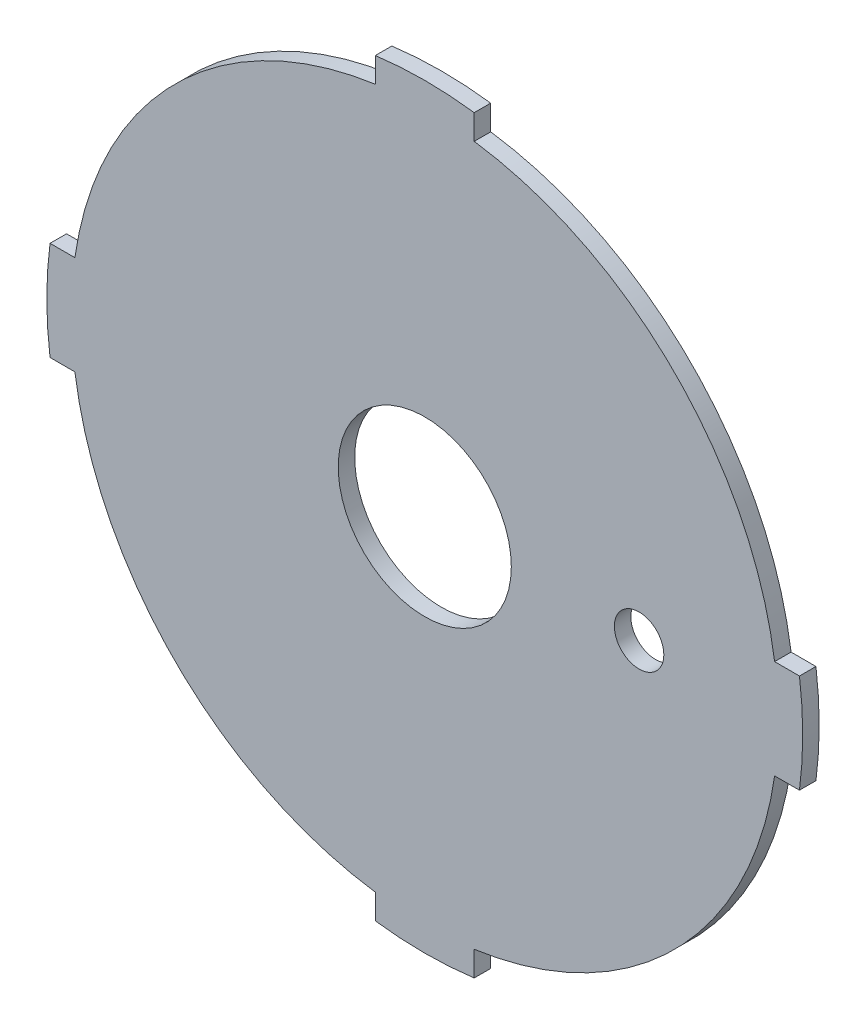
ISO-10303-21;
HEADER;
FILE_DESCRIPTION(('STEP AP214'),'2;1');
FILE_NAME('part.step','',(''),(''),'','','');
FILE_SCHEMA(('AUTOMOTIVE_DESIGN { 1 0 10303 214 1 1 1 1 }'));
ENDSEC;
DATA;
#1=APPLICATION_CONTEXT('core data for automotive mechanical design processes');
#2=APPLICATION_PROTOCOL_DEFINITION('international standard','automotive_design',2000,#1);
#3=PRODUCT_CONTEXT('',#1,'mechanical');
#4=PRODUCT('Part','Part','',(#3));
#5=PRODUCT_RELATED_PRODUCT_CATEGORY('part','',(#4));
#6=PRODUCT_DEFINITION_FORMATION('','',#4);
#7=PRODUCT_DEFINITION_CONTEXT('part definition',#1,'design');
#8=PRODUCT_DEFINITION('design','',#6,#7);
#9=PRODUCT_DEFINITION_SHAPE('','',#8);
#10=(LENGTH_UNIT() NAMED_UNIT(*) SI_UNIT(.MILLI.,.METRE.));
#11=(NAMED_UNIT(*) PLANE_ANGLE_UNIT() SI_UNIT($,.RADIAN.));
#12=(NAMED_UNIT(*) SI_UNIT($,.STERADIAN.) SOLID_ANGLE_UNIT());
#13=UNCERTAINTY_MEASURE_WITH_UNIT(LENGTH_MEASURE(1.E-05),#10,'distance_accuracy_value','');
#14=(GEOMETRIC_REPRESENTATION_CONTEXT(3) GLOBAL_UNCERTAINTY_ASSIGNED_CONTEXT((#13)) GLOBAL_UNIT_ASSIGNED_CONTEXT((#10,
#11,#12)) REPRESENTATION_CONTEXT('',''));
#15=CARTESIAN_POINT('',(0.,0.,0.));
#16=DIRECTION('',(0.,0.,1.));
#17=DIRECTION('',(1.,0.,0.));
#18=AXIS2_PLACEMENT_3D('',#15,#16,#17);
#19=CARTESIAN_POINT('',(0.,0.,2.));
#20=DIRECTION('',(0.,0.,-1.));
#21=DIRECTION('',(-1.,0.,0.));
#22=AXIS2_PLACEMENT_3D('',#19,#20,#21);
#23=CYLINDRICAL_SURFACE('',#22,45.85);
#24=CARTESIAN_POINT('',(0.,0.,0.));
#25=DIRECTION('',(0.,0.,1.));
#26=DIRECTION('',(1.,0.,0.));
#27=AXIS2_PLACEMENT_3D('',#24,#25,#26);
#28=CIRCLE('',#27,45.85);
#29=CARTESIAN_POINT('',(-5.99999999999968,-45.4557202120922,0.));
#30=VERTEX_POINT('',#29);
#31=CARTESIAN_POINT('',(6.00000000000047,-45.4557202120921,0.));
#32=VERTEX_POINT('',#31);
#33=EDGE_CURVE('E223',#30,#32,#28,.T.);
#34=ORIENTED_EDGE('',*,*,#33,.T.);
#35=DIRECTION('',(0.,0.,-1.));
#36=VECTOR('',#35,1.);
#37=CARTESIAN_POINT('',(6.00000000000047,-45.4557202120921,2.001));
#38=LINE('',#37,#36);
#39=CARTESIAN_POINT('',(6.00000000000047,-45.4557202120921,2.));
#40=VERTEX_POINT('',#39);
#41=EDGE_CURVE('E235',#40,#32,#38,.T.);
#42=ORIENTED_EDGE('',*,*,#41,.F.);
#43=CARTESIAN_POINT('',(0.,0.,2.));
#44=DIRECTION('',(0.,0.,1.));
#45=DIRECTION('',(1.,0.,0.));
#46=AXIS2_PLACEMENT_3D('',#43,#44,#45);
#47=CIRCLE('',#46,45.85);
#48=CARTESIAN_POINT('',(-5.99999999999971,-45.4557202120921,2.));
#49=VERTEX_POINT('',#48);
#50=EDGE_CURVE('E214',#49,#40,#47,.T.);
#51=ORIENTED_EDGE('',*,*,#50,.F.);
#52=DIRECTION('',(0.,0.,-1.));
#53=VECTOR('',#52,1.);
#54=CARTESIAN_POINT('',(-5.99999999999971,-45.4557202120921,2.001));
#55=LINE('',#54,#53);
#56=EDGE_CURVE('E236',#49,#30,#55,.T.);
#57=ORIENTED_EDGE('',*,*,#56,.T.);
#58=EDGE_LOOP('',(#34,#42,#51,#57));
#59=FACE_BOUND('',#58,.T.);
#60=ADVANCED_FACE('F38',(#59),#23,.T.);
#61=CARTESIAN_POINT('',(-45.4557202120921,5.99999999999984,0.));
#62=VERTEX_POINT('',#61);
#63=CARTESIAN_POINT('',(-45.4557202120921,-6.00000000000031,0.));
#64=VERTEX_POINT('',#63);
#65=EDGE_CURVE('E220',#62,#64,#28,.T.);
#66=ORIENTED_EDGE('',*,*,#65,.T.);
#67=DIRECTION('',(0.,0.,-1.));
#68=VECTOR('',#67,1.);
#69=CARTESIAN_POINT('',(-45.4557202120921,-6.00000000000031,2.001));
#70=LINE('',#69,#68);
#71=CARTESIAN_POINT('',(-45.4557202120921,-6.00000000000031,2.));
#72=VERTEX_POINT('',#71);
#73=EDGE_CURVE('E342',#72,#64,#70,.T.);
#74=ORIENTED_EDGE('',*,*,#73,.F.);
#75=CARTESIAN_POINT('',(-45.4557202120921,5.99999999999985,2.));
#76=VERTEX_POINT('',#75);
#77=EDGE_CURVE('E48',#76,#72,#47,.T.);
#78=ORIENTED_EDGE('',*,*,#77,.F.);
#79=DIRECTION('',(0.,0.,-1.));
#80=VECTOR('',#79,1.);
#81=CARTESIAN_POINT('',(-45.4557202120921,5.99999999999985,2.001));
#82=LINE('',#81,#80);
#83=EDGE_CURVE('E175',#76,#62,#82,.T.);
#84=ORIENTED_EDGE('',*,*,#83,.T.);
#85=EDGE_LOOP('',(#66,#74,#78,#84));
#86=FACE_BOUND('',#85,.T.);
#87=ADVANCED_FACE('F377',(#86),#23,.T.);
#88=CARTESIAN_POINT('',(6.,45.4557202120921,0.));
#89=VERTEX_POINT('',#88);
#90=CARTESIAN_POINT('',(-6.00000000000016,45.4557202120921,0.));
#91=VERTEX_POINT('',#90);
#92=EDGE_CURVE('E173',#89,#91,#28,.T.);
#93=ORIENTED_EDGE('',*,*,#92,.T.);
#94=DIRECTION('',(0.,0.,-1.));
#95=VECTOR('',#94,1.);
#96=CARTESIAN_POINT('',(-6.00000000000016,45.4557202120921,2.001));
#97=LINE('',#96,#95);
#98=CARTESIAN_POINT('',(-6.00000000000016,45.4557202120921,2.));
#99=VERTEX_POINT('',#98);
#100=EDGE_CURVE('E158',#99,#91,#97,.T.);
#101=ORIENTED_EDGE('',*,*,#100,.F.);
#102=CARTESIAN_POINT('',(6.,45.4557202120921,2.));
#103=VERTEX_POINT('',#102);
#104=EDGE_CURVE('E11',#103,#99,#47,.T.);
#105=ORIENTED_EDGE('',*,*,#104,.F.);
#106=DIRECTION('',(0.,0.,-1.));
#107=VECTOR('',#106,1.);
#108=CARTESIAN_POINT('',(6.,45.4557202120921,2.001));
#109=LINE('',#108,#107);
#110=EDGE_CURVE('E288',#103,#89,#109,.T.);
#111=ORIENTED_EDGE('',*,*,#110,.T.);
#112=EDGE_LOOP('',(#93,#101,#105,#111));
#113=FACE_BOUND('',#112,.T.);
#114=ADVANCED_FACE('F170',(#113),#23,.T.);
#115=CARTESIAN_POINT('',(0.,0.,2.));
#116=DIRECTION('',(0.,0.,1.));
#117=DIRECTION('',(1.,0.,0.));
#118=AXIS2_PLACEMENT_3D('',#115,#116,#117);
#119=PLANE('',#118);
#120=DIRECTION('',(0.,1.,0.));
#121=VECTOR('',#120,1.);
#122=CARTESIAN_POINT('',(6.00000000000044,-42.4379499976141,2.));
#123=LINE('',#122,#121);
#124=CARTESIAN_POINT('',(6.00000000000044,-42.4379499976141,2.));
#125=VERTEX_POINT('',#124);
#126=EDGE_CURVE('E356',#40,#125,#123,.T.);
#127=ORIENTED_EDGE('',*,*,#126,.T.);
#128=CARTESIAN_POINT('',(0.,0.,2.));
#129=DIRECTION('',(0.,0.,1.));
#130=DIRECTION('',(1.,0.,0.));
#131=AXIS2_PLACEMENT_3D('',#128,#129,#130);
#132=CIRCLE('',#131,42.86);
#133=CARTESIAN_POINT('',(42.4379499976142,-5.99999999999956,2.));
#134=VERTEX_POINT('',#133);
#135=EDGE_CURVE('E352',#125,#134,#132,.T.);
#136=ORIENTED_EDGE('',*,*,#135,.T.);
#137=DIRECTION('',(1.,0.,0.));
#138=VECTOR('',#137,1.);
#139=CARTESIAN_POINT('',(42.4379499976142,-5.99999999999956,2.));
#140=LINE('',#139,#138);
#141=CARTESIAN_POINT('',(45.4557202120922,-5.99999999999955,2.));
#142=VERTEX_POINT('',#141);
#143=EDGE_CURVE('E262',#134,#142,#140,.T.);
#144=ORIENTED_EDGE('',*,*,#143,.T.);
#145=CARTESIAN_POINT('',(45.4557202120921,6.,2.));
#146=VERTEX_POINT('',#145);
#147=EDGE_CURVE('E49',#142,#146,#47,.T.);
#148=ORIENTED_EDGE('',*,*,#147,.T.);
#149=DIRECTION('',(-1.,0.,0.));
#150=VECTOR('',#149,1.);
#151=CARTESIAN_POINT('',(42.4379499976142,5.99999999999999,2.));
#152=LINE('',#151,#150);
#153=CARTESIAN_POINT('',(42.4379499976142,5.99999999999999,2.));
#154=VERTEX_POINT('',#153);
#155=EDGE_CURVE('E272',#146,#154,#152,.T.);
#156=ORIENTED_EDGE('',*,*,#155,.T.);
#157=CARTESIAN_POINT('',(0.,0.,2.));
#158=DIRECTION('',(0.,0.,1.));
#159=DIRECTION('',(1.,0.,0.));
#160=AXIS2_PLACEMENT_3D('',#157,#158,#159);
#161=CIRCLE('',#160,42.86);
#162=CARTESIAN_POINT('',(6.,42.4379499976142,2.));
#163=VERTEX_POINT('',#162);
#164=EDGE_CURVE('E184',#154,#163,#161,.T.);
#165=ORIENTED_EDGE('',*,*,#164,.T.);
#166=DIRECTION('',(0.,1.,0.));
#167=VECTOR('',#166,1.);
#168=CARTESIAN_POINT('',(6.,42.4379499976142,2.));
#169=LINE('',#168,#167);
#170=EDGE_CURVE('E182',#163,#103,#169,.T.);
#171=ORIENTED_EDGE('',*,*,#170,.T.);
#172=ORIENTED_EDGE('',*,*,#104,.T.);
#173=DIRECTION('',(0.,-1.,0.));
#174=VECTOR('',#173,1.);
#175=CARTESIAN_POINT('',(-6.00000000000015,42.4379499976141,2.));
#176=LINE('',#175,#174);
#177=CARTESIAN_POINT('',(-6.00000000000015,42.4379499976142,2.));
#178=VERTEX_POINT('',#177);
#179=EDGE_CURVE('E154',#99,#178,#176,.T.);
#180=ORIENTED_EDGE('',*,*,#179,.T.);
#181=CARTESIAN_POINT('',(0.,0.,2.));
#182=DIRECTION('',(0.,0.,1.));
#183=DIRECTION('',(1.,0.,0.));
#184=AXIS2_PLACEMENT_3D('',#181,#182,#183);
#185=CIRCLE('',#184,42.86);
#186=CARTESIAN_POINT('',(-42.4379499976142,5.99999999999985,2.));
#187=VERTEX_POINT('',#186);
#188=EDGE_CURVE('E165',#178,#187,#185,.T.);
#189=ORIENTED_EDGE('',*,*,#188,.T.);
#190=DIRECTION('',(-1.,0.,0.));
#191=VECTOR('',#190,1.);
#192=CARTESIAN_POINT('',(-42.4379499976142,5.99999999999985,2.));
#193=LINE('',#192,#191);
#194=EDGE_CURVE('E273',#187,#76,#193,.T.);
#195=ORIENTED_EDGE('',*,*,#194,.T.);
#196=ORIENTED_EDGE('',*,*,#77,.T.);
#197=DIRECTION('',(1.,0.,0.));
#198=VECTOR('',#197,1.);
#199=CARTESIAN_POINT('',(-42.4379499976141,-6.00000000000029,2.));
#200=LINE('',#199,#198);
#201=CARTESIAN_POINT('',(-42.4379499976141,-6.00000000000029,2.));
#202=VERTEX_POINT('',#201);
#203=EDGE_CURVE('E323',#72,#202,#200,.T.);
#204=ORIENTED_EDGE('',*,*,#203,.T.);
#205=CARTESIAN_POINT('',(0.,0.,2.));
#206=DIRECTION('',(0.,0.,1.));
#207=DIRECTION('',(1.,0.,0.));
#208=AXIS2_PLACEMENT_3D('',#205,#206,#207);
#209=CIRCLE('',#208,42.86);
#210=CARTESIAN_POINT('',(-5.9999999999997,-42.4379499976142,2.));
#211=VERTEX_POINT('',#210);
#212=EDGE_CURVE('E269',#202,#211,#209,.T.);
#213=ORIENTED_EDGE('',*,*,#212,.T.);
#214=DIRECTION('',(0.,-1.,0.));
#215=VECTOR('',#214,1.);
#216=CARTESIAN_POINT('',(-5.9999999999997,-42.4379499976142,2.));
#217=LINE('',#216,#215);
#218=EDGE_CURVE('E341',#211,#49,#217,.T.);
#219=ORIENTED_EDGE('',*,*,#218,.T.);
#220=ORIENTED_EDGE('',*,*,#50,.T.);
#221=EDGE_LOOP('',(#127,#136,#144,#148,#156,#165,#171,#172,#180,#189,#195,#196,#204,#213,#219,#220));
#222=FACE_BOUND('',#221,.T.);
#223=CARTESIAN_POINT('',(26.,0.,2.));
#224=DIRECTION('',(0.,0.,1.));
#225=DIRECTION('',(1.,0.,0.));
#226=AXIS2_PLACEMENT_3D('',#223,#224,#225);
#227=CIRCLE('',#226,3.);
#228=CARTESIAN_POINT('',(29.,0.,2.));
#229=VERTEX_POINT('',#228);
#230=EDGE_CURVE('E188',#229,#229,#227,.F.);
#231=ORIENTED_EDGE('',*,*,#230,.T.);
#232=EDGE_LOOP('',(#231));
#233=FACE_BOUND('',#232,.T.);
#234=CARTESIAN_POINT('',(0.,0.,2.));
#235=DIRECTION('',(0.,0.,1.));
#236=DIRECTION('',(1.,0.,0.));
#237=AXIS2_PLACEMENT_3D('',#234,#235,#236);
#238=CIRCLE('',#237,10.5);
#239=CARTESIAN_POINT('',(10.5,0.,2.));
#240=VERTEX_POINT('',#239);
#241=EDGE_CURVE('E206',#240,#240,#238,.T.);
#242=ORIENTED_EDGE('',*,*,#241,.F.);
#243=EDGE_LOOP('',(#242));
#244=FACE_BOUND('',#243,.T.);
#245=ADVANCED_FACE('F179',(#222,#233,#244),#119,.T.);
#246=CARTESIAN_POINT('',(0.,0.,0.));
#247=DIRECTION('',(0.,0.,1.));
#248=DIRECTION('',(1.,0.,0.));
#249=AXIS2_PLACEMENT_3D('',#246,#247,#248);
#250=PLANE('',#249);
#251=CARTESIAN_POINT('',(26.,0.,0.));
#252=DIRECTION('',(0.,0.,-1.));
#253=DIRECTION('',(-1.,0.,0.));
#254=AXIS2_PLACEMENT_3D('',#251,#252,#253);
#255=CIRCLE('',#254,3.);
#256=CARTESIAN_POINT('',(23.,0.,0.));
#257=VERTEX_POINT('',#256);
#258=EDGE_CURVE('E194',#257,#257,#255,.T.);
#259=ORIENTED_EDGE('',*,*,#258,.F.);
#260=EDGE_LOOP('',(#259));
#261=FACE_BOUND('',#260,.T.);
#262=CARTESIAN_POINT('',(0.,0.,0.));
#263=DIRECTION('',(0.,0.,1.));
#264=DIRECTION('',(1.,0.,0.));
#265=AXIS2_PLACEMENT_3D('',#262,#263,#264);
#266=CIRCLE('',#265,42.86);
#267=CARTESIAN_POINT('',(6.00000000000044,-42.4379499976141,0.));
#268=VERTEX_POINT('',#267);
#269=CARTESIAN_POINT('',(42.4379499976142,-5.99999999999956,0.));
#270=VERTEX_POINT('',#269);
#271=EDGE_CURVE('E246',#268,#270,#266,.T.);
#272=ORIENTED_EDGE('',*,*,#271,.F.);
#273=DIRECTION('',(0.,1.,0.));
#274=VECTOR('',#273,1.);
#275=CARTESIAN_POINT('',(6.00000000000044,-42.4379499976141,0.));
#276=LINE('',#275,#274);
#277=EDGE_CURVE('E244',#32,#268,#276,.T.);
#278=ORIENTED_EDGE('',*,*,#277,.F.);
#279=ORIENTED_EDGE('',*,*,#33,.F.);
#280=DIRECTION('',(0.,-1.,0.));
#281=VECTOR('',#280,1.);
#282=CARTESIAN_POINT('',(-5.9999999999997,-42.4379499976142,0.));
#283=LINE('',#282,#281);
#284=CARTESIAN_POINT('',(-5.9999999999997,-42.4379499976142,0.));
#285=VERTEX_POINT('',#284);
#286=EDGE_CURVE('E64',#285,#30,#283,.T.);
#287=ORIENTED_EDGE('',*,*,#286,.F.);
#288=CARTESIAN_POINT('',(0.,0.,0.));
#289=DIRECTION('',(0.,0.,1.));
#290=DIRECTION('',(1.,0.,0.));
#291=AXIS2_PLACEMENT_3D('',#288,#289,#290);
#292=CIRCLE('',#291,42.86);
#293=CARTESIAN_POINT('',(-42.4379499976141,-6.00000000000029,0.));
#294=VERTEX_POINT('',#293);
#295=EDGE_CURVE('E327',#294,#285,#292,.T.);
#296=ORIENTED_EDGE('',*,*,#295,.F.);
#297=DIRECTION('',(1.,0.,0.));
#298=VECTOR('',#297,1.);
#299=CARTESIAN_POINT('',(-42.4379499976141,-6.00000000000029,0.));
#300=LINE('',#299,#298);
#301=EDGE_CURVE('E333',#64,#294,#300,.T.);
#302=ORIENTED_EDGE('',*,*,#301,.F.);
#303=ORIENTED_EDGE('',*,*,#65,.F.);
#304=DIRECTION('',(-1.,0.,0.));
#305=VECTOR('',#304,1.);
#306=CARTESIAN_POINT('',(-42.4379499976142,5.99999999999985,0.));
#307=LINE('',#306,#305);
#308=CARTESIAN_POINT('',(-42.4379499976142,5.99999999999985,0.));
#309=VERTEX_POINT('',#308);
#310=EDGE_CURVE('E304',#309,#62,#307,.T.);
#311=ORIENTED_EDGE('',*,*,#310,.F.);
#312=CARTESIAN_POINT('',(0.,0.,0.));
#313=DIRECTION('',(0.,0.,1.));
#314=DIRECTION('',(1.,0.,0.));
#315=AXIS2_PLACEMENT_3D('',#312,#313,#314);
#316=CIRCLE('',#315,42.86);
#317=CARTESIAN_POINT('',(-6.00000000000015,42.4379499976141,0.));
#318=VERTEX_POINT('',#317);
#319=EDGE_CURVE('E164',#318,#309,#316,.T.);
#320=ORIENTED_EDGE('',*,*,#319,.F.);
#321=DIRECTION('',(0.,-1.,0.));
#322=VECTOR('',#321,1.);
#323=CARTESIAN_POINT('',(-6.00000000000015,42.4379499976141,0.));
#324=LINE('',#323,#322);
#325=EDGE_CURVE('E299',#91,#318,#324,.T.);
#326=ORIENTED_EDGE('',*,*,#325,.F.);
#327=ORIENTED_EDGE('',*,*,#92,.F.);
#328=DIRECTION('',(0.,1.,0.));
#329=VECTOR('',#328,1.);
#330=CARTESIAN_POINT('',(6.,42.4379499976142,0.));
#331=LINE('',#330,#329);
#332=CARTESIAN_POINT('',(6.,42.4379499976142,0.));
#333=VERTEX_POINT('',#332);
#334=EDGE_CURVE('E280',#333,#89,#331,.T.);
#335=ORIENTED_EDGE('',*,*,#334,.F.);
#336=CARTESIAN_POINT('',(0.,0.,0.));
#337=DIRECTION('',(0.,0.,1.));
#338=DIRECTION('',(1.,0.,0.));
#339=AXIS2_PLACEMENT_3D('',#336,#337,#338);
#340=CIRCLE('',#339,42.86);
#341=CARTESIAN_POINT('',(42.4379499976142,5.99999999999999,0.));
#342=VERTEX_POINT('',#341);
#343=EDGE_CURVE('E276',#342,#333,#340,.T.);
#344=ORIENTED_EDGE('',*,*,#343,.F.);
#345=DIRECTION('',(-1.,0.,0.));
#346=VECTOR('',#345,1.);
#347=CARTESIAN_POINT('',(42.4379499976142,5.99999999999999,0.));
#348=LINE('',#347,#346);
#349=CARTESIAN_POINT('',(45.4557202120921,5.99999999999999,0.));
#350=VERTEX_POINT('',#349);
#351=EDGE_CURVE('E283',#350,#342,#348,.T.);
#352=ORIENTED_EDGE('',*,*,#351,.F.);
#353=CARTESIAN_POINT('',(45.4557202120922,-5.99999999999952,0.));
#354=VERTEX_POINT('',#353);
#355=EDGE_CURVE('E42',#354,#350,#28,.T.);
#356=ORIENTED_EDGE('',*,*,#355,.F.);
#357=DIRECTION('',(1.,0.,0.));
#358=VECTOR('',#357,1.);
#359=CARTESIAN_POINT('',(42.4379499976142,-5.99999999999956,0.));
#360=LINE('',#359,#358);
#361=EDGE_CURVE('E56',#270,#354,#360,.T.);
#362=ORIENTED_EDGE('',*,*,#361,.F.);
#363=EDGE_LOOP('',(#272,#278,#279,#287,#296,#302,#303,#311,#320,#326,#327,#335,#344,#352,#356,#362));
#364=FACE_BOUND('',#363,.T.);
#365=CARTESIAN_POINT('',(0.,0.,0.));
#366=DIRECTION('',(0.,0.,1.));
#367=DIRECTION('',(1.,0.,0.));
#368=AXIS2_PLACEMENT_3D('',#365,#366,#367);
#369=CIRCLE('',#368,10.5);
#370=CARTESIAN_POINT('',(10.5,0.,0.));
#371=VERTEX_POINT('',#370);
#372=EDGE_CURVE('E204',#371,#371,#369,.T.);
#373=ORIENTED_EDGE('',*,*,#372,.T.);
#374=EDGE_LOOP('',(#373));
#375=FACE_BOUND('',#374,.T.);
#376=ADVANCED_FACE('F240',(#261,#364,#375),#250,.F.);
#377=ORIENTED_EDGE('',*,*,#147,.F.);
#378=DIRECTION('',(0.,0.,-1.));
#379=VECTOR('',#378,1.);
#380=CARTESIAN_POINT('',(45.4557202120922,-5.99999999999955,2.001));
#381=LINE('',#380,#379);
#382=EDGE_CURVE('E254',#142,#354,#381,.T.);
#383=ORIENTED_EDGE('',*,*,#382,.T.);
#384=ORIENTED_EDGE('',*,*,#355,.T.);
#385=DIRECTION('',(0.,0.,-1.));
#386=VECTOR('',#385,1.);
#387=CARTESIAN_POINT('',(45.4557202120921,5.99999999999999,2.001));
#388=LINE('',#387,#386);
#389=EDGE_CURVE('E196',#146,#350,#388,.T.);
#390=ORIENTED_EDGE('',*,*,#389,.F.);
#391=EDGE_LOOP('',(#377,#383,#384,#390));
#392=FACE_BOUND('',#391,.T.);
#393=ADVANCED_FACE('F40',(#392),#23,.T.);
#394=CARTESIAN_POINT('',(0.,0.,2.));
#395=DIRECTION('',(0.,0.,-1.));
#396=DIRECTION('',(-1.,0.,0.));
#397=AXIS2_PLACEMENT_3D('',#394,#395,#396);
#398=CYLINDRICAL_SURFACE('',#397,10.5);
#399=ORIENTED_EDGE('',*,*,#241,.T.);
#400=EDGE_LOOP('',(#399));
#401=FACE_BOUND('',#400,.T.);
#402=ORIENTED_EDGE('',*,*,#372,.F.);
#403=EDGE_LOOP('',(#402));
#404=FACE_BOUND('',#403,.T.);
#405=ADVANCED_FACE('F384',(#401,#404),#398,.F.);
#406=CARTESIAN_POINT('',(26.,0.,2.001));
#407=DIRECTION('',(0.,0.,-1.));
#408=DIRECTION('',(-1.,0.,0.));
#409=AXIS2_PLACEMENT_3D('',#406,#407,#408);
#410=CYLINDRICAL_SURFACE('',#409,3.);
#411=ORIENTED_EDGE('',*,*,#230,.F.);
#412=EDGE_LOOP('',(#411));
#413=FACE_BOUND('',#412,.T.);
#414=ORIENTED_EDGE('',*,*,#258,.T.);
#415=EDGE_LOOP('',(#414));
#416=FACE_BOUND('',#415,.T.);
#417=ADVANCED_FACE('F390',(#413,#416),#410,.F.);
#418=CARTESIAN_POINT('',(0.,0.,2.001));
#419=DIRECTION('',(0.,0.,-1.));
#420=DIRECTION('',(-1.,0.,0.));
#421=AXIS2_PLACEMENT_3D('',#418,#419,#420);
#422=CYLINDRICAL_SURFACE('',#421,42.86);
#423=DIRECTION('',(0.,0.,-1.));
#424=VECTOR('',#423,1.);
#425=CARTESIAN_POINT('',(42.4379499976142,5.99999999999999,2.001));
#426=LINE('',#425,#424);
#427=EDGE_CURVE('E189',#154,#342,#426,.T.);
#428=ORIENTED_EDGE('',*,*,#427,.T.);
#429=ORIENTED_EDGE('',*,*,#343,.T.);
#430=DIRECTION('',(0.,0.,-1.));
#431=VECTOR('',#430,1.);
#432=CARTESIAN_POINT('',(6.,42.4379499976142,2.001));
#433=LINE('',#432,#431);
#434=EDGE_CURVE('E200',#163,#333,#433,.T.);
#435=ORIENTED_EDGE('',*,*,#434,.F.);
#436=ORIENTED_EDGE('',*,*,#164,.F.);
#437=EDGE_LOOP('',(#428,#429,#435,#436));
#438=FACE_BOUND('',#437,.T.);
#439=ADVANCED_FACE('F295',(#438),#422,.T.);
#440=CARTESIAN_POINT('',(42.4379499976142,5.99999999999999,2.001));
#441=DIRECTION('',(0.,-1.,0.));
#442=DIRECTION('',(0.,0.,-1.));
#443=AXIS2_PLACEMENT_3D('',#440,#441,#442);
#444=PLANE('',#443);
#445=ORIENTED_EDGE('',*,*,#389,.T.);
#446=ORIENTED_EDGE('',*,*,#351,.T.);
#447=ORIENTED_EDGE('',*,*,#427,.F.);
#448=ORIENTED_EDGE('',*,*,#155,.F.);
#449=EDGE_LOOP('',(#445,#446,#447,#448));
#450=FACE_BOUND('',#449,.T.);
#451=ADVANCED_FACE('F363',(#450),#444,.F.);
#452=CARTESIAN_POINT('',(6.,42.4379499976142,2.001));
#453=DIRECTION('',(-1.,0.,0.));
#454=DIRECTION('',(0.,-1.,0.));
#455=AXIS2_PLACEMENT_3D('',#452,#453,#454);
#456=PLANE('',#455);
#457=ORIENTED_EDGE('',*,*,#434,.T.);
#458=ORIENTED_EDGE('',*,*,#334,.T.);
#459=ORIENTED_EDGE('',*,*,#110,.F.);
#460=ORIENTED_EDGE('',*,*,#170,.F.);
#461=EDGE_LOOP('',(#457,#458,#459,#460));
#462=FACE_BOUND('',#461,.T.);
#463=ADVANCED_FACE('F291',(#462),#456,.F.);
#464=CARTESIAN_POINT('',(0.,0.,2.001));
#465=DIRECTION('',(0.,0.,-1.));
#466=DIRECTION('',(-1.,0.,0.));
#467=AXIS2_PLACEMENT_3D('',#464,#465,#466);
#468=CYLINDRICAL_SURFACE('',#467,42.86);
#469=DIRECTION('',(0.,0.,-1.));
#470=VECTOR('',#469,1.);
#471=CARTESIAN_POINT('',(-6.00000000000015,42.4379499976141,2.001));
#472=LINE('',#471,#470);
#473=EDGE_CURVE('E160',#178,#318,#472,.T.);
#474=ORIENTED_EDGE('',*,*,#473,.T.);
#475=ORIENTED_EDGE('',*,*,#319,.T.);
#476=DIRECTION('',(0.,0.,-1.));
#477=VECTOR('',#476,1.);
#478=CARTESIAN_POINT('',(-42.4379499976142,5.99999999999985,2.001));
#479=LINE('',#478,#477);
#480=EDGE_CURVE('E303',#187,#309,#479,.T.);
#481=ORIENTED_EDGE('',*,*,#480,.F.);
#482=ORIENTED_EDGE('',*,*,#188,.F.);
#483=EDGE_LOOP('',(#474,#475,#481,#482));
#484=FACE_BOUND('',#483,.T.);
#485=ADVANCED_FACE('F409',(#484),#468,.T.);
#486=CARTESIAN_POINT('',(-6.00000000000015,42.4379499976141,2.001));
#487=DIRECTION('',(1.,0.,0.));
#488=DIRECTION('',(0.,1.,0.));
#489=AXIS2_PLACEMENT_3D('',#486,#487,#488);
#490=PLANE('',#489);
#491=ORIENTED_EDGE('',*,*,#100,.T.);
#492=ORIENTED_EDGE('',*,*,#325,.T.);
#493=ORIENTED_EDGE('',*,*,#473,.F.);
#494=ORIENTED_EDGE('',*,*,#179,.F.);
#495=EDGE_LOOP('',(#491,#492,#493,#494));
#496=FACE_BOUND('',#495,.T.);
#497=ADVANCED_FACE('F156',(#496),#490,.F.);
#498=CARTESIAN_POINT('',(-42.4379499976142,5.99999999999985,2.001));
#499=DIRECTION('',(0.,-1.,0.));
#500=DIRECTION('',(1.,0.,0.));
#501=AXIS2_PLACEMENT_3D('',#498,#499,#500);
#502=PLANE('',#501);
#503=ORIENTED_EDGE('',*,*,#480,.T.);
#504=ORIENTED_EDGE('',*,*,#310,.T.);
#505=ORIENTED_EDGE('',*,*,#83,.F.);
#506=ORIENTED_EDGE('',*,*,#194,.F.);
#507=EDGE_LOOP('',(#503,#504,#505,#506));
#508=FACE_BOUND('',#507,.T.);
#509=ADVANCED_FACE('F432',(#508),#502,.F.);
#510=CARTESIAN_POINT('',(0.,0.,2.001));
#511=DIRECTION('',(0.,0.,-1.));
#512=DIRECTION('',(-1.,0.,0.));
#513=AXIS2_PLACEMENT_3D('',#510,#511,#512);
#514=CYLINDRICAL_SURFACE('',#513,42.86);
#515=DIRECTION('',(0.,0.,-1.));
#516=VECTOR('',#515,1.);
#517=CARTESIAN_POINT('',(-42.4379499976141,-6.00000000000029,2.001));
#518=LINE('',#517,#516);
#519=EDGE_CURVE('E338',#202,#294,#518,.T.);
#520=ORIENTED_EDGE('',*,*,#519,.T.);
#521=ORIENTED_EDGE('',*,*,#295,.T.);
#522=DIRECTION('',(0.,0.,-1.));
#523=VECTOR('',#522,1.);
#524=CARTESIAN_POINT('',(-5.9999999999997,-42.4379499976142,2.001));
#525=LINE('',#524,#523);
#526=EDGE_CURVE('E337',#211,#285,#525,.T.);
#527=ORIENTED_EDGE('',*,*,#526,.F.);
#528=ORIENTED_EDGE('',*,*,#212,.F.);
#529=EDGE_LOOP('',(#520,#521,#527,#528));
#530=FACE_BOUND('',#529,.T.);
#531=ADVANCED_FACE('F439',(#530),#514,.T.);
#532=CARTESIAN_POINT('',(-42.4379499976141,-6.00000000000029,2.001));
#533=DIRECTION('',(0.,1.,0.));
#534=DIRECTION('',(-1.,0.,0.));
#535=AXIS2_PLACEMENT_3D('',#532,#533,#534);
#536=PLANE('',#535);
#537=ORIENTED_EDGE('',*,*,#73,.T.);
#538=ORIENTED_EDGE('',*,*,#301,.T.);
#539=ORIENTED_EDGE('',*,*,#519,.F.);
#540=ORIENTED_EDGE('',*,*,#203,.F.);
#541=EDGE_LOOP('',(#537,#538,#539,#540));
#542=FACE_BOUND('',#541,.T.);
#543=ADVANCED_FACE('F447',(#542),#536,.F.);
#544=CARTESIAN_POINT('',(-5.9999999999997,-42.4379499976142,2.001));
#545=DIRECTION('',(1.,0.,0.));
#546=DIRECTION('',(0.,1.,0.));
#547=AXIS2_PLACEMENT_3D('',#544,#545,#546);
#548=PLANE('',#547);
#549=ORIENTED_EDGE('',*,*,#526,.T.);
#550=ORIENTED_EDGE('',*,*,#286,.T.);
#551=ORIENTED_EDGE('',*,*,#56,.F.);
#552=ORIENTED_EDGE('',*,*,#218,.F.);
#553=EDGE_LOOP('',(#549,#550,#551,#552));
#554=FACE_BOUND('',#553,.T.);
#555=ADVANCED_FACE('F373',(#554),#548,.F.);
#556=CARTESIAN_POINT('',(0.,0.,2.001));
#557=DIRECTION('',(0.,0.,-1.));
#558=DIRECTION('',(-1.,0.,0.));
#559=AXIS2_PLACEMENT_3D('',#556,#557,#558);
#560=CYLINDRICAL_SURFACE('',#559,42.86);
#561=DIRECTION('',(0.,0.,-1.));
#562=VECTOR('',#561,1.);
#563=CARTESIAN_POINT('',(6.00000000000044,-42.4379499976141,2.001));
#564=LINE('',#563,#562);
#565=EDGE_CURVE('E259',#125,#268,#564,.T.);
#566=ORIENTED_EDGE('',*,*,#565,.T.);
#567=ORIENTED_EDGE('',*,*,#271,.T.);
#568=DIRECTION('',(0.,0.,-1.));
#569=VECTOR('',#568,1.);
#570=CARTESIAN_POINT('',(42.4379499976142,-5.99999999999956,2.001));
#571=LINE('',#570,#569);
#572=EDGE_CURVE('E250',#134,#270,#571,.T.);
#573=ORIENTED_EDGE('',*,*,#572,.F.);
#574=ORIENTED_EDGE('',*,*,#135,.F.);
#575=EDGE_LOOP('',(#566,#567,#573,#574));
#576=FACE_BOUND('',#575,.T.);
#577=ADVANCED_FACE('F361',(#576),#560,.T.);
#578=CARTESIAN_POINT('',(6.00000000000044,-42.4379499976141,2.001));
#579=DIRECTION('',(-1.,0.,0.));
#580=DIRECTION('',(0.,-1.,0.));
#581=AXIS2_PLACEMENT_3D('',#578,#579,#580);
#582=PLANE('',#581);
#583=ORIENTED_EDGE('',*,*,#41,.T.);
#584=ORIENTED_EDGE('',*,*,#277,.T.);
#585=ORIENTED_EDGE('',*,*,#565,.F.);
#586=ORIENTED_EDGE('',*,*,#126,.F.);
#587=EDGE_LOOP('',(#583,#584,#585,#586));
#588=FACE_BOUND('',#587,.T.);
#589=ADVANCED_FACE('F365',(#588),#582,.F.);
#590=CARTESIAN_POINT('',(42.4379499976142,-5.99999999999956,2.001));
#591=DIRECTION('',(0.,1.,0.));
#592=DIRECTION('',(-1.,0.,0.));
#593=AXIS2_PLACEMENT_3D('',#590,#591,#592);
#594=PLANE('',#593);
#595=ORIENTED_EDGE('',*,*,#572,.T.);
#596=ORIENTED_EDGE('',*,*,#361,.T.);
#597=ORIENTED_EDGE('',*,*,#382,.F.);
#598=ORIENTED_EDGE('',*,*,#143,.F.);
#599=EDGE_LOOP('',(#595,#596,#597,#598));
#600=FACE_BOUND('',#599,.T.);
#601=ADVANCED_FACE('F364',(#600),#594,.F.);
#602=CLOSED_SHELL('',(#60,#87,#114,#245,#376,#393,#405,#417,#439,#451,#463,#485,#497,#509,#531,
#543,#555,#577,#589,#601));
#603=MANIFOLD_SOLID_BREP('B2',#602);
#604=ADVANCED_BREP_SHAPE_REPRESENTATION('',(#18,#603),#14);
#605=SHAPE_DEFINITION_REPRESENTATION(#9,#604);
ENDSEC;
END-ISO-10303-21;
